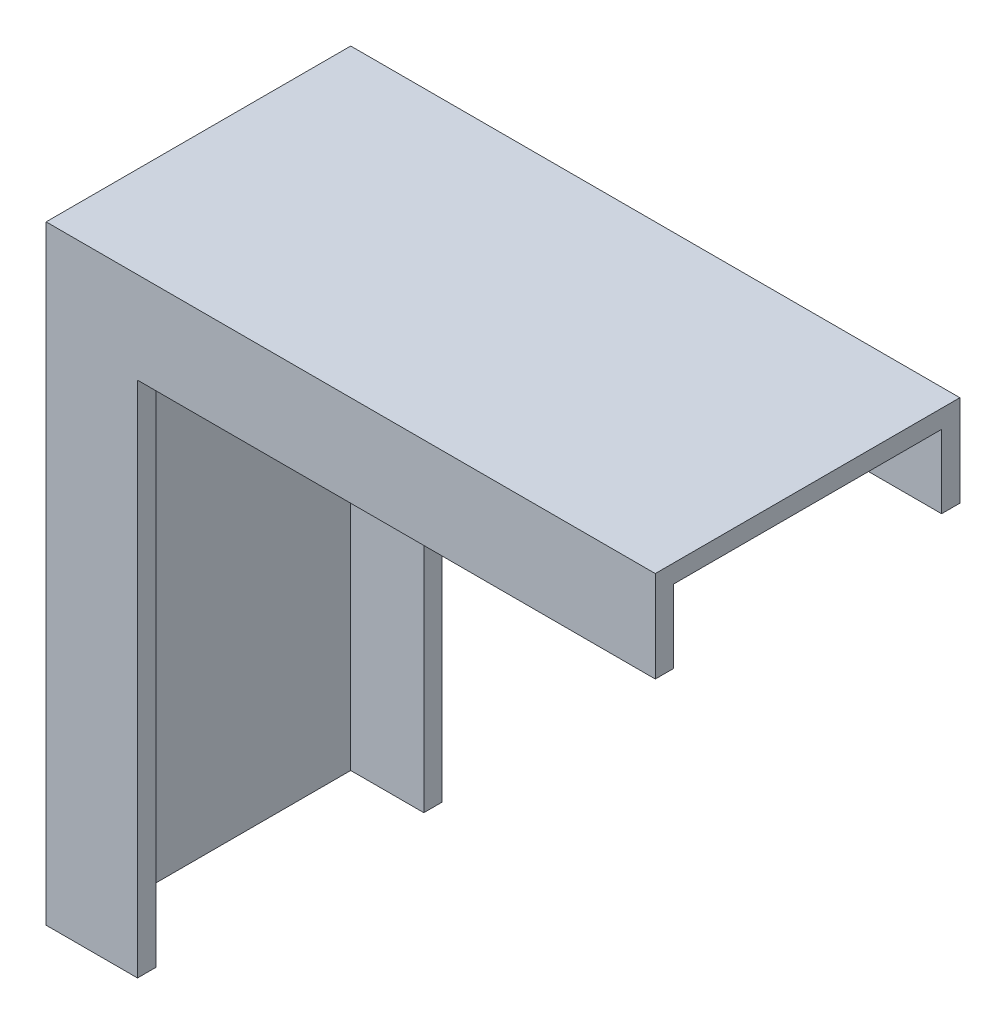
ISO-10303-21;
HEADER;
FILE_DESCRIPTION(('STEP AP214'),'2;1');
FILE_NAME('part.step','',(''),(''),'','','');
FILE_SCHEMA(('AUTOMOTIVE_DESIGN { 1 0 10303 214 1 1 1 1 }'));
ENDSEC;
DATA;
#1=APPLICATION_CONTEXT('core data for automotive mechanical design processes');
#2=APPLICATION_PROTOCOL_DEFINITION('international standard','automotive_design',2000,#1);
#3=PRODUCT_CONTEXT('',#1,'mechanical');
#4=PRODUCT('Part','Part','',(#3));
#5=PRODUCT_RELATED_PRODUCT_CATEGORY('part','',(#4));
#6=PRODUCT_DEFINITION_FORMATION('','',#4);
#7=PRODUCT_DEFINITION_CONTEXT('part definition',#1,'design');
#8=PRODUCT_DEFINITION('design','',#6,#7);
#9=PRODUCT_DEFINITION_SHAPE('','',#8);
#10=(LENGTH_UNIT() NAMED_UNIT(*) SI_UNIT(.MILLI.,.METRE.));
#11=(NAMED_UNIT(*) PLANE_ANGLE_UNIT() SI_UNIT($,.RADIAN.));
#12=(NAMED_UNIT(*) SI_UNIT($,.STERADIAN.) SOLID_ANGLE_UNIT());
#13=UNCERTAINTY_MEASURE_WITH_UNIT(LENGTH_MEASURE(1.E-05),#10,'distance_accuracy_value','');
#14=(GEOMETRIC_REPRESENTATION_CONTEXT(3) GLOBAL_UNCERTAINTY_ASSIGNED_CONTEXT((#13)) GLOBAL_UNIT_ASSIGNED_CONTEXT((#10,
#11,#12)) REPRESENTATION_CONTEXT('',''));
#15=CARTESIAN_POINT('',(0.,0.,0.));
#16=DIRECTION('',(0.,0.,1.));
#17=DIRECTION('',(1.,0.,0.));
#18=AXIS2_PLACEMENT_3D('',#15,#16,#17);
#19=CARTESIAN_POINT('',(0.,85.,50.0000000000001));
#20=DIRECTION('',(0.,1.,0.));
#21=DIRECTION('',(0.,0.,1.));
#22=AXIS2_PLACEMENT_3D('',#19,#20,#21);
#23=PLANE('',#22);
#24=DIRECTION('',(0.,0.,-1.));
#25=VECTOR('',#24,1.);
#26=CARTESIAN_POINT('',(15.,85.,50.0000000000001));
#27=LINE('',#26,#25);
#28=CARTESIAN_POINT('',(15.,85.,50.0000000000001));
#29=VERTEX_POINT('',#28);
#30=CARTESIAN_POINT('',(15.,85.,47.0000000000001));
#31=VERTEX_POINT('',#30);
#32=EDGE_CURVE('E145',#29,#31,#27,.T.);
#33=ORIENTED_EDGE('',*,*,#32,.T.);
#34=DIRECTION('',(1.,0.,0.));
#35=VECTOR('',#34,1.);
#36=CARTESIAN_POINT('',(0.,85.,47.0000000000001));
#37=LINE('',#36,#35);
#38=CARTESIAN_POINT('',(100.,85.,47.0000000000001));
#39=VERTEX_POINT('',#38);
#40=EDGE_CURVE('E134',#31,#39,#37,.T.);
#41=ORIENTED_EDGE('',*,*,#40,.T.);
#42=DIRECTION('',(0.,0.,-1.));
#43=VECTOR('',#42,1.);
#44=CARTESIAN_POINT('',(100.,85.,50.0000000000001));
#45=LINE('',#44,#43);
#46=CARTESIAN_POINT('',(100.,85.,50.0000000000001));
#47=VERTEX_POINT('',#46);
#48=EDGE_CURVE('E154',#47,#39,#45,.T.);
#49=ORIENTED_EDGE('',*,*,#48,.F.);
#50=DIRECTION('',(1.,0.,0.));
#51=VECTOR('',#50,1.);
#52=CARTESIAN_POINT('',(0.,85.,50.0000000000001));
#53=LINE('',#52,#51);
#54=EDGE_CURVE('E92',#29,#47,#53,.T.);
#55=ORIENTED_EDGE('',*,*,#54,.F.);
#56=EDGE_LOOP('',(#33,#41,#49,#55));
#57=FACE_BOUND('',#56,.T.);
#58=ADVANCED_FACE('F33',(#57),#23,.F.);
#59=CARTESIAN_POINT('',(15.,0.,50.0000000000001));
#60=DIRECTION('',(-1.,0.,0.));
#61=DIRECTION('',(0.,0.,1.));
#62=AXIS2_PLACEMENT_3D('',#59,#60,#61);
#63=PLANE('',#62);
#64=DIRECTION('',(0.,0.,-1.));
#65=VECTOR('',#64,1.);
#66=CARTESIAN_POINT('',(15.,0.,50.0000000000001));
#67=LINE('',#66,#65);
#68=CARTESIAN_POINT('',(15.,0.,50.0000000000001));
#69=VERTEX_POINT('',#68);
#70=CARTESIAN_POINT('',(15.,0.,47.0000000000001));
#71=VERTEX_POINT('',#70);
#72=EDGE_CURVE('E116',#69,#71,#67,.T.);
#73=ORIENTED_EDGE('',*,*,#72,.T.);
#74=DIRECTION('',(0.,1.,0.));
#75=VECTOR('',#74,1.);
#76=CARTESIAN_POINT('',(15.,0.,47.0000000000001));
#77=LINE('',#76,#75);
#78=EDGE_CURVE('E41',#71,#31,#77,.T.);
#79=ORIENTED_EDGE('',*,*,#78,.T.);
#80=ORIENTED_EDGE('',*,*,#32,.F.);
#81=DIRECTION('',(0.,1.,0.));
#82=VECTOR('',#81,1.);
#83=CARTESIAN_POINT('',(15.,0.,50.0000000000001));
#84=LINE('',#83,#82);
#85=EDGE_CURVE('E57',#69,#29,#84,.T.);
#86=ORIENTED_EDGE('',*,*,#85,.F.);
#87=EDGE_LOOP('',(#73,#79,#80,#86));
#88=FACE_BOUND('',#87,.T.);
#89=ADVANCED_FACE('F161',(#88),#63,.F.);
#90=CARTESIAN_POINT('',(100.,85.,3.));
#91=VERTEX_POINT('',#90);
#92=CARTESIAN_POINT('',(100.,85.,0.));
#93=VERTEX_POINT('',#92);
#94=EDGE_CURVE('E153',#91,#93,#45,.T.);
#95=ORIENTED_EDGE('',*,*,#94,.F.);
#96=DIRECTION('',(-1.,0.,0.));
#97=VECTOR('',#96,1.);
#98=CARTESIAN_POINT('',(0.,85.,3.));
#99=LINE('',#98,#97);
#100=CARTESIAN_POINT('',(15.,85.,3.));
#101=VERTEX_POINT('',#100);
#102=EDGE_CURVE('E192',#91,#101,#99,.T.);
#103=ORIENTED_EDGE('',*,*,#102,.T.);
#104=CARTESIAN_POINT('',(15.,85.,0.));
#105=VERTEX_POINT('',#104);
#106=EDGE_CURVE('E86',#101,#105,#27,.T.);
#107=ORIENTED_EDGE('',*,*,#106,.T.);
#108=DIRECTION('',(1.,0.,0.));
#109=VECTOR('',#108,1.);
#110=CARTESIAN_POINT('',(0.,85.,0.));
#111=LINE('',#110,#109);
#112=EDGE_CURVE('E131',#105,#93,#111,.T.);
#113=ORIENTED_EDGE('',*,*,#112,.T.);
#114=EDGE_LOOP('',(#95,#103,#107,#113));
#115=FACE_BOUND('',#114,.T.);
#116=ADVANCED_FACE('F35',(#115),#23,.F.);
#117=CARTESIAN_POINT('',(100.,100.,50.0000000000001));
#118=DIRECTION('',(1.,0.,0.));
#119=DIRECTION('',(0.,0.,-1.));
#120=AXIS2_PLACEMENT_3D('',#117,#118,#119);
#121=PLANE('',#120);
#122=DIRECTION('',(0.,-1.,0.));
#123=VECTOR('',#122,1.);
#124=CARTESIAN_POINT('',(100.,97.,47.0000000000001));
#125=LINE('',#124,#123);
#126=CARTESIAN_POINT('',(100.,97.,47.0000000000001));
#127=VERTEX_POINT('',#126);
#128=EDGE_CURVE('E213',#127,#39,#125,.T.);
#129=ORIENTED_EDGE('',*,*,#128,.F.);
#130=DIRECTION('',(0.,0.,1.));
#131=VECTOR('',#130,1.);
#132=CARTESIAN_POINT('',(100.,97.,47.0000000000001));
#133=LINE('',#132,#131);
#134=CARTESIAN_POINT('',(100.,97.,3.));
#135=VERTEX_POINT('',#134);
#136=EDGE_CURVE('E207',#135,#127,#133,.T.);
#137=ORIENTED_EDGE('',*,*,#136,.F.);
#138=DIRECTION('',(0.,1.,0.));
#139=VECTOR('',#138,1.);
#140=CARTESIAN_POINT('',(100.,97.,3.));
#141=LINE('',#140,#139);
#142=EDGE_CURVE('E211',#91,#135,#141,.T.);
#143=ORIENTED_EDGE('',*,*,#142,.F.);
#144=ORIENTED_EDGE('',*,*,#94,.T.);
#145=DIRECTION('',(0.,-1.,0.));
#146=VECTOR('',#145,1.);
#147=CARTESIAN_POINT('',(100.,100.,0.));
#148=LINE('',#147,#146);
#149=CARTESIAN_POINT('',(100.,100.,0.));
#150=VERTEX_POINT('',#149);
#151=EDGE_CURVE('E133',#150,#93,#148,.T.);
#152=ORIENTED_EDGE('',*,*,#151,.F.);
#153=DIRECTION('',(0.,0.,-1.));
#154=VECTOR('',#153,1.);
#155=CARTESIAN_POINT('',(100.,100.,50.0000000000001));
#156=LINE('',#155,#154);
#157=CARTESIAN_POINT('',(100.,100.,50.0000000000001));
#158=VERTEX_POINT('',#157);
#159=EDGE_CURVE('E151',#158,#150,#156,.T.);
#160=ORIENTED_EDGE('',*,*,#159,.F.);
#161=DIRECTION('',(0.,-1.,0.));
#162=VECTOR('',#161,1.);
#163=CARTESIAN_POINT('',(100.,100.,50.0000000000001));
#164=LINE('',#163,#162);
#165=EDGE_CURVE('E170',#158,#47,#164,.T.);
#166=ORIENTED_EDGE('',*,*,#165,.T.);
#167=ORIENTED_EDGE('',*,*,#48,.T.);
#168=EDGE_LOOP('',(#129,#137,#143,#144,#152,#160,#166,#167));
#169=FACE_BOUND('',#168,.T.);
#170=ADVANCED_FACE('F247',(#169),#121,.T.);
#171=CARTESIAN_POINT('',(0.,100.,50.0000000000001));
#172=DIRECTION('',(0.,1.,0.));
#173=DIRECTION('',(0.,0.,1.));
#174=AXIS2_PLACEMENT_3D('',#171,#172,#173);
#175=PLANE('',#174);
#176=DIRECTION('',(1.,0.,0.));
#177=VECTOR('',#176,1.);
#178=CARTESIAN_POINT('',(0.,100.,0.));
#179=LINE('',#178,#177);
#180=CARTESIAN_POINT('',(0.,100.,0.));
#181=VERTEX_POINT('',#180);
#182=EDGE_CURVE('E137',#181,#150,#179,.T.);
#183=ORIENTED_EDGE('',*,*,#182,.F.);
#184=DIRECTION('',(0.,0.,-1.));
#185=VECTOR('',#184,1.);
#186=CARTESIAN_POINT('',(0.,100.,50.0000000000001));
#187=LINE('',#186,#185);
#188=CARTESIAN_POINT('',(0.,100.,50.0000000000001));
#189=VERTEX_POINT('',#188);
#190=EDGE_CURVE('E115',#189,#181,#187,.T.);
#191=ORIENTED_EDGE('',*,*,#190,.F.);
#192=DIRECTION('',(1.,0.,0.));
#193=VECTOR('',#192,1.);
#194=CARTESIAN_POINT('',(0.,100.,50.0000000000001));
#195=LINE('',#194,#193);
#196=EDGE_CURVE('E122',#189,#158,#195,.T.);
#197=ORIENTED_EDGE('',*,*,#196,.T.);
#198=ORIENTED_EDGE('',*,*,#159,.T.);
#199=EDGE_LOOP('',(#183,#191,#197,#198));
#200=FACE_BOUND('',#199,.T.);
#201=ADVANCED_FACE('F177',(#200),#175,.T.);
#202=CARTESIAN_POINT('',(0.,0.,50.0000000000001));
#203=DIRECTION('',(-1.,0.,0.));
#204=DIRECTION('',(0.,0.,1.));
#205=AXIS2_PLACEMENT_3D('',#202,#203,#204);
#206=PLANE('',#205);
#207=DIRECTION('',(0.,1.,0.));
#208=VECTOR('',#207,1.);
#209=CARTESIAN_POINT('',(0.,0.,0.));
#210=LINE('',#209,#208);
#211=CARTESIAN_POINT('',(0.,0.,0.));
#212=VERTEX_POINT('',#211);
#213=EDGE_CURVE('E110',#212,#181,#210,.T.);
#214=ORIENTED_EDGE('',*,*,#213,.F.);
#215=DIRECTION('',(0.,0.,-1.));
#216=VECTOR('',#215,1.);
#217=CARTESIAN_POINT('',(0.,0.,50.0000000000001));
#218=LINE('',#217,#216);
#219=CARTESIAN_POINT('',(0.,0.,50.0000000000001));
#220=VERTEX_POINT('',#219);
#221=EDGE_CURVE('E105',#220,#212,#218,.T.);
#222=ORIENTED_EDGE('',*,*,#221,.F.);
#223=DIRECTION('',(0.,1.,0.));
#224=VECTOR('',#223,1.);
#225=CARTESIAN_POINT('',(0.,0.,50.0000000000001));
#226=LINE('',#225,#224);
#227=EDGE_CURVE('E108',#220,#189,#226,.T.);
#228=ORIENTED_EDGE('',*,*,#227,.T.);
#229=ORIENTED_EDGE('',*,*,#190,.T.);
#230=EDGE_LOOP('',(#214,#222,#228,#229));
#231=FACE_BOUND('',#230,.T.);
#232=ADVANCED_FACE('F107',(#231),#206,.T.);
#233=CARTESIAN_POINT('',(15.,0.,50.0000000000001));
#234=DIRECTION('',(0.,-1.,0.));
#235=DIRECTION('',(0.,0.,-1.));
#236=AXIS2_PLACEMENT_3D('',#233,#234,#235);
#237=PLANE('',#236);
#238=DIRECTION('',(-1.,0.,0.));
#239=VECTOR('',#238,1.);
#240=CARTESIAN_POINT('',(15.,0.,47.0000000000001));
#241=LINE('',#240,#239);
#242=CARTESIAN_POINT('',(2.99999999999993,0.,47.0000000000001));
#243=VERTEX_POINT('',#242);
#244=EDGE_CURVE('E196',#71,#243,#241,.T.);
#245=ORIENTED_EDGE('',*,*,#244,.F.);
#246=ORIENTED_EDGE('',*,*,#72,.F.);
#247=DIRECTION('',(-1.,0.,0.));
#248=VECTOR('',#247,1.);
#249=CARTESIAN_POINT('',(15.,0.,50.0000000000001));
#250=LINE('',#249,#248);
#251=EDGE_CURVE('E120',#69,#220,#250,.T.);
#252=ORIENTED_EDGE('',*,*,#251,.T.);
#253=ORIENTED_EDGE('',*,*,#221,.T.);
#254=DIRECTION('',(-1.,0.,0.));
#255=VECTOR('',#254,1.);
#256=CARTESIAN_POINT('',(15.,0.,0.));
#257=LINE('',#256,#255);
#258=CARTESIAN_POINT('',(15.,0.,0.));
#259=VERTEX_POINT('',#258);
#260=EDGE_CURVE('E141',#259,#212,#257,.T.);
#261=ORIENTED_EDGE('',*,*,#260,.F.);
#262=CARTESIAN_POINT('',(15.,0.,3.));
#263=VERTEX_POINT('',#262);
#264=EDGE_CURVE('E148',#263,#259,#67,.T.);
#265=ORIENTED_EDGE('',*,*,#264,.F.);
#266=DIRECTION('',(1.,0.,0.));
#267=VECTOR('',#266,1.);
#268=CARTESIAN_POINT('',(15.,0.,2.99999999999999));
#269=LINE('',#268,#267);
#270=CARTESIAN_POINT('',(2.99999999999993,0.,2.99999999999999));
#271=VERTEX_POINT('',#270);
#272=EDGE_CURVE('E48',#271,#263,#269,.T.);
#273=ORIENTED_EDGE('',*,*,#272,.F.);
#274=DIRECTION('',(0.,0.,1.));
#275=VECTOR('',#274,1.);
#276=CARTESIAN_POINT('',(2.99999999999993,0.,50.0000000000001));
#277=LINE('',#276,#275);
#278=EDGE_CURVE('E11',#271,#243,#277,.T.);
#279=ORIENTED_EDGE('',*,*,#278,.T.);
#280=EDGE_LOOP('',(#245,#246,#252,#253,#261,#265,#273,#279));
#281=FACE_BOUND('',#280,.T.);
#282=ADVANCED_FACE('F125',(#281),#237,.T.);
#283=ORIENTED_EDGE('',*,*,#106,.F.);
#284=DIRECTION('',(0.,-1.,0.));
#285=VECTOR('',#284,1.);
#286=CARTESIAN_POINT('',(15.,0.,2.99999999999999));
#287=LINE('',#286,#285);
#288=EDGE_CURVE('E157',#101,#263,#287,.T.);
#289=ORIENTED_EDGE('',*,*,#288,.T.);
#290=ORIENTED_EDGE('',*,*,#264,.T.);
#291=DIRECTION('',(0.,1.,0.));
#292=VECTOR('',#291,1.);
#293=CARTESIAN_POINT('',(15.,0.,0.));
#294=LINE('',#293,#292);
#295=EDGE_CURVE('E143',#259,#105,#294,.T.);
#296=ORIENTED_EDGE('',*,*,#295,.T.);
#297=EDGE_LOOP('',(#283,#289,#290,#296));
#298=FACE_BOUND('',#297,.T.);
#299=ADVANCED_FACE('F186',(#298),#63,.F.);
#300=CARTESIAN_POINT('',(0.,0.,50.0000000000001));
#301=DIRECTION('',(0.,0.,-1.));
#302=DIRECTION('',(-1.,0.,0.));
#303=AXIS2_PLACEMENT_3D('',#300,#301,#302);
#304=PLANE('',#303);
#305=ORIENTED_EDGE('',*,*,#54,.T.);
#306=ORIENTED_EDGE('',*,*,#165,.F.);
#307=ORIENTED_EDGE('',*,*,#196,.F.);
#308=ORIENTED_EDGE('',*,*,#227,.F.);
#309=ORIENTED_EDGE('',*,*,#251,.F.);
#310=ORIENTED_EDGE('',*,*,#85,.T.);
#311=EDGE_LOOP('',(#305,#306,#307,#308,#309,#310));
#312=FACE_BOUND('',#311,.T.);
#313=ADVANCED_FACE('F119',(#312),#304,.F.);
#314=CARTESIAN_POINT('',(0.,0.,0.));
#315=DIRECTION('',(0.,0.,-1.));
#316=DIRECTION('',(-1.,0.,0.));
#317=AXIS2_PLACEMENT_3D('',#314,#315,#316);
#318=PLANE('',#317);
#319=ORIENTED_EDGE('',*,*,#112,.F.);
#320=ORIENTED_EDGE('',*,*,#295,.F.);
#321=ORIENTED_EDGE('',*,*,#260,.T.);
#322=ORIENTED_EDGE('',*,*,#213,.T.);
#323=ORIENTED_EDGE('',*,*,#182,.T.);
#324=ORIENTED_EDGE('',*,*,#151,.T.);
#325=EDGE_LOOP('',(#319,#320,#321,#322,#323,#324));
#326=FACE_BOUND('',#325,.T.);
#327=ADVANCED_FACE('F181',(#326),#318,.T.);
#328=CARTESIAN_POINT('',(2.99999999999993,97.,47.0000000000001));
#329=DIRECTION('',(0.,0.,1.));
#330=DIRECTION('',(0.,-1.,0.));
#331=AXIS2_PLACEMENT_3D('',#328,#329,#330);
#332=PLANE('',#331);
#333=ORIENTED_EDGE('',*,*,#78,.F.);
#334=ORIENTED_EDGE('',*,*,#244,.T.);
#335=DIRECTION('',(0.,-1.,0.));
#336=VECTOR('',#335,1.);
#337=CARTESIAN_POINT('',(2.99999999999993,97.,47.0000000000001));
#338=LINE('',#337,#336);
#339=CARTESIAN_POINT('',(2.99999999999993,97.,47.0000000000001));
#340=VERTEX_POINT('',#339);
#341=EDGE_CURVE('E210',#340,#243,#338,.T.);
#342=ORIENTED_EDGE('',*,*,#341,.F.);
#343=DIRECTION('',(1.,0.,0.));
#344=VECTOR('',#343,1.);
#345=CARTESIAN_POINT('',(2.99999999999993,97.,47.0000000000001));
#346=LINE('',#345,#344);
#347=EDGE_CURVE('E198',#340,#127,#346,.T.);
#348=ORIENTED_EDGE('',*,*,#347,.T.);
#349=ORIENTED_EDGE('',*,*,#128,.T.);
#350=ORIENTED_EDGE('',*,*,#40,.F.);
#351=EDGE_LOOP('',(#333,#334,#342,#348,#349,#350));
#352=FACE_BOUND('',#351,.T.);
#353=ADVANCED_FACE('F230',(#352),#332,.F.);
#354=CARTESIAN_POINT('',(2.99999999999993,97.,3.));
#355=DIRECTION('',(0.,0.,-1.));
#356=DIRECTION('',(0.,1.,0.));
#357=AXIS2_PLACEMENT_3D('',#354,#355,#356);
#358=PLANE('',#357);
#359=ORIENTED_EDGE('',*,*,#142,.T.);
#360=DIRECTION('',(1.,0.,0.));
#361=VECTOR('',#360,1.);
#362=CARTESIAN_POINT('',(2.99999999999993,97.,3.));
#363=LINE('',#362,#361);
#364=CARTESIAN_POINT('',(2.99999999999993,97.,3.));
#365=VERTEX_POINT('',#364);
#366=EDGE_CURVE('E201',#365,#135,#363,.T.);
#367=ORIENTED_EDGE('',*,*,#366,.F.);
#368=DIRECTION('',(0.,1.,0.));
#369=VECTOR('',#368,1.);
#370=CARTESIAN_POINT('',(2.99999999999993,97.,3.));
#371=LINE('',#370,#369);
#372=EDGE_CURVE('E218',#271,#365,#371,.T.);
#373=ORIENTED_EDGE('',*,*,#372,.F.);
#374=ORIENTED_EDGE('',*,*,#272,.T.);
#375=ORIENTED_EDGE('',*,*,#288,.F.);
#376=ORIENTED_EDGE('',*,*,#102,.F.);
#377=EDGE_LOOP('',(#359,#367,#373,#374,#375,#376));
#378=FACE_BOUND('',#377,.T.);
#379=ADVANCED_FACE('F190',(#378),#358,.F.);
#380=CARTESIAN_POINT('',(2.99999999999993,97.,47.0000000000001));
#381=DIRECTION('',(0.,1.,0.));
#382=DIRECTION('',(0.,0.,1.));
#383=AXIS2_PLACEMENT_3D('',#380,#381,#382);
#384=PLANE('',#383);
#385=ORIENTED_EDGE('',*,*,#136,.T.);
#386=ORIENTED_EDGE('',*,*,#347,.F.);
#387=DIRECTION('',(0.,0.,1.));
#388=VECTOR('',#387,1.);
#389=CARTESIAN_POINT('',(2.99999999999993,97.,47.0000000000001));
#390=LINE('',#389,#388);
#391=EDGE_CURVE('E204',#365,#340,#390,.T.);
#392=ORIENTED_EDGE('',*,*,#391,.F.);
#393=ORIENTED_EDGE('',*,*,#366,.T.);
#394=EDGE_LOOP('',(#385,#386,#392,#393));
#395=FACE_BOUND('',#394,.T.);
#396=ADVANCED_FACE('F237',(#395),#384,.F.);
#397=CARTESIAN_POINT('',(2.99999999999993,0.,0.));
#398=DIRECTION('',(1.,0.,0.));
#399=DIRECTION('',(0.,0.,-1.));
#400=AXIS2_PLACEMENT_3D('',#397,#398,#399);
#401=PLANE('',#400);
#402=ORIENTED_EDGE('',*,*,#372,.T.);
#403=ORIENTED_EDGE('',*,*,#391,.T.);
#404=ORIENTED_EDGE('',*,*,#341,.T.);
#405=ORIENTED_EDGE('',*,*,#278,.F.);
#406=EDGE_LOOP('',(#402,#403,#404,#405));
#407=FACE_BOUND('',#406,.T.);
#408=ADVANCED_FACE('F226',(#407),#401,.T.);
#409=CLOSED_SHELL('',(#58,#89,#116,#170,#201,#232,#282,#299,#313,#327,#353,#379,#396,#408));
#410=MANIFOLD_SOLID_BREP('B2',#409);
#411=ADVANCED_BREP_SHAPE_REPRESENTATION('',(#18,#410),#14);
#412=SHAPE_DEFINITION_REPRESENTATION(#9,#411);
ENDSEC;
END-ISO-10303-21;
